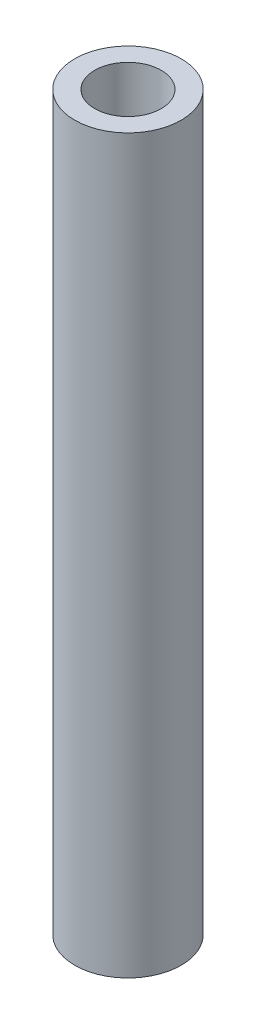
ISO-10303-21;
HEADER;
FILE_DESCRIPTION(('STEP AP214'),'2;1');
FILE_NAME('part.step','',(''),(''),'','','');
FILE_SCHEMA(('AUTOMOTIVE_DESIGN { 1 0 10303 214 1 1 1 1 }'));
ENDSEC;
DATA;
#1=APPLICATION_CONTEXT('core data for automotive mechanical design processes');
#2=APPLICATION_PROTOCOL_DEFINITION('international standard','automotive_design',2000,#1);
#3=PRODUCT_CONTEXT('',#1,'mechanical');
#4=PRODUCT('Part','Part','',(#3));
#5=PRODUCT_RELATED_PRODUCT_CATEGORY('part','',(#4));
#6=PRODUCT_DEFINITION_FORMATION('','',#4);
#7=PRODUCT_DEFINITION_CONTEXT('part definition',#1,'design');
#8=PRODUCT_DEFINITION('design','',#6,#7);
#9=PRODUCT_DEFINITION_SHAPE('','',#8);
#10=(LENGTH_UNIT() NAMED_UNIT(*) SI_UNIT(.MILLI.,.METRE.));
#11=(NAMED_UNIT(*) PLANE_ANGLE_UNIT() SI_UNIT($,.RADIAN.));
#12=(NAMED_UNIT(*) SI_UNIT($,.STERADIAN.) SOLID_ANGLE_UNIT());
#13=UNCERTAINTY_MEASURE_WITH_UNIT(LENGTH_MEASURE(1.E-05),#10,'distance_accuracy_value','');
#14=(GEOMETRIC_REPRESENTATION_CONTEXT(3) GLOBAL_UNCERTAINTY_ASSIGNED_CONTEXT((#13)) GLOBAL_UNIT_ASSIGNED_CONTEXT((#10,
#11,#12)) REPRESENTATION_CONTEXT('',''));
#15=CARTESIAN_POINT('',(0.,0.,0.));
#16=DIRECTION('',(0.,0.,1.));
#17=DIRECTION('',(1.,0.,0.));
#18=AXIS2_PLACEMENT_3D('',#15,#16,#17);
#19=CARTESIAN_POINT('',(0.,55.,0.));
#20=DIRECTION('',(0.,1.,0.));
#21=DIRECTION('',(0.,0.,1.));
#22=AXIS2_PLACEMENT_3D('',#19,#20,#21);
#23=PLANE('',#22);
#24=CARTESIAN_POINT('',(0.,55.,0.));
#25=DIRECTION('',(0.,1.,0.));
#26=DIRECTION('',(0.,0.,1.));
#27=AXIS2_PLACEMENT_3D('',#24,#25,#26);
#28=CIRCLE('',#27,4.);
#29=CARTESIAN_POINT('',(0.,55.,4.));
#30=VERTEX_POINT('',#29);
#31=EDGE_CURVE('E10',#30,#30,#28,.T.);
#32=ORIENTED_EDGE('',*,*,#31,.T.);
#33=EDGE_LOOP('',(#32));
#34=FACE_BOUND('',#33,.T.);
#35=CARTESIAN_POINT('',(0.,55.,0.));
#36=DIRECTION('',(0.,1.,0.));
#37=DIRECTION('',(0.,0.,1.));
#38=AXIS2_PLACEMENT_3D('',#35,#36,#37);
#39=CIRCLE('',#38,2.5);
#40=CARTESIAN_POINT('',(0.,55.,2.5));
#41=VERTEX_POINT('',#40);
#42=EDGE_CURVE('E42',#41,#41,#39,.T.);
#43=ORIENTED_EDGE('',*,*,#42,.F.);
#44=EDGE_LOOP('',(#43));
#45=FACE_BOUND('',#44,.T.);
#46=ADVANCED_FACE('F31',(#34,#45),#23,.T.);
#47=CARTESIAN_POINT('',(0.,0.,0.));
#48=DIRECTION('',(0.,1.,0.));
#49=DIRECTION('',(0.,0.,1.));
#50=AXIS2_PLACEMENT_3D('',#47,#48,#49);
#51=PLANE('',#50);
#52=CARTESIAN_POINT('',(0.,0.,0.));
#53=DIRECTION('',(0.,1.,0.));
#54=DIRECTION('',(0.,0.,1.));
#55=AXIS2_PLACEMENT_3D('',#52,#53,#54);
#56=CIRCLE('',#55,4.);
#57=CARTESIAN_POINT('',(0.,0.,4.));
#58=VERTEX_POINT('',#57);
#59=EDGE_CURVE('E35',#58,#58,#56,.T.);
#60=ORIENTED_EDGE('',*,*,#59,.F.);
#61=EDGE_LOOP('',(#60));
#62=FACE_BOUND('',#61,.T.);
#63=CARTESIAN_POINT('',(0.,0.,0.));
#64=DIRECTION('',(0.,1.,0.));
#65=DIRECTION('',(0.,0.,1.));
#66=AXIS2_PLACEMENT_3D('',#63,#64,#65);
#67=CIRCLE('',#66,2.5);
#68=CARTESIAN_POINT('',(0.,0.,2.5));
#69=VERTEX_POINT('',#68);
#70=EDGE_CURVE('E44',#69,#69,#67,.T.);
#71=ORIENTED_EDGE('',*,*,#70,.T.);
#72=EDGE_LOOP('',(#71));
#73=FACE_BOUND('',#72,.T.);
#74=ADVANCED_FACE('F54',(#62,#73),#51,.F.);
#75=CARTESIAN_POINT('',(0.,55.,0.));
#76=DIRECTION('',(0.,-1.,0.));
#77=DIRECTION('',(0.,0.,-1.));
#78=AXIS2_PLACEMENT_3D('',#75,#76,#77);
#79=CYLINDRICAL_SURFACE('',#78,4.);
#80=ORIENTED_EDGE('',*,*,#31,.F.);
#81=EDGE_LOOP('',(#80));
#82=FACE_BOUND('',#81,.T.);
#83=ORIENTED_EDGE('',*,*,#59,.T.);
#84=EDGE_LOOP('',(#83));
#85=FACE_BOUND('',#84,.T.);
#86=ADVANCED_FACE('F33',(#82,#85),#79,.T.);
#87=CARTESIAN_POINT('',(0.,55.,0.));
#88=DIRECTION('',(0.,-1.,0.));
#89=DIRECTION('',(0.,0.,-1.));
#90=AXIS2_PLACEMENT_3D('',#87,#88,#89);
#91=CYLINDRICAL_SURFACE('',#90,2.5);
#92=ORIENTED_EDGE('',*,*,#42,.T.);
#93=EDGE_LOOP('',(#92));
#94=FACE_BOUND('',#93,.T.);
#95=ORIENTED_EDGE('',*,*,#70,.F.);
#96=EDGE_LOOP('',(#95));
#97=FACE_BOUND('',#96,.T.);
#98=ADVANCED_FACE('F50',(#94,#97),#91,.F.);
#99=CLOSED_SHELL('',(#46,#74,#86,#98));
#100=MANIFOLD_SOLID_BREP('B2',#99);
#101=ADVANCED_BREP_SHAPE_REPRESENTATION('',(#18,#100),#14);
#102=SHAPE_DEFINITION_REPRESENTATION(#9,#101);
ENDSEC;
END-ISO-10303-21;
